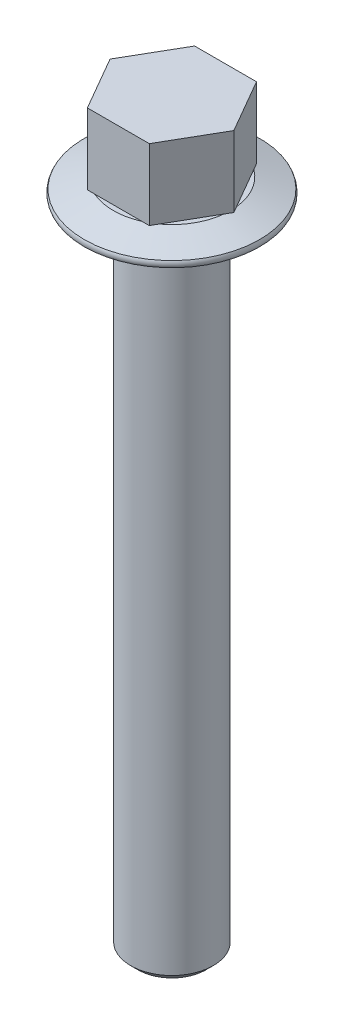
ISO-10303-21;
HEADER;
FILE_DESCRIPTION(('STEP AP214'),'2;1');
FILE_NAME('part.step','',(''),(''),'','','');
FILE_SCHEMA(('AUTOMOTIVE_DESIGN { 1 0 10303 214 1 1 1 1 }'));
ENDSEC;
DATA;
#1=APPLICATION_CONTEXT('core data for automotive mechanical design processes');
#2=APPLICATION_PROTOCOL_DEFINITION('international standard','automotive_design',2000,#1);
#3=PRODUCT_CONTEXT('',#1,'mechanical');
#4=PRODUCT('Part','Part','',(#3));
#5=PRODUCT_RELATED_PRODUCT_CATEGORY('part','',(#4));
#6=PRODUCT_DEFINITION_FORMATION('','',#4);
#7=PRODUCT_DEFINITION_CONTEXT('part definition',#1,'design');
#8=PRODUCT_DEFINITION('design','',#6,#7);
#9=PRODUCT_DEFINITION_SHAPE('','',#8);
#10=(LENGTH_UNIT() NAMED_UNIT(*) SI_UNIT(.MILLI.,.METRE.));
#11=(NAMED_UNIT(*) PLANE_ANGLE_UNIT() SI_UNIT($,.RADIAN.));
#12=(NAMED_UNIT(*) SI_UNIT($,.STERADIAN.) SOLID_ANGLE_UNIT());
#13=UNCERTAINTY_MEASURE_WITH_UNIT(LENGTH_MEASURE(1.E-05),#10,'distance_accuracy_value','');
#14=(GEOMETRIC_REPRESENTATION_CONTEXT(3) GLOBAL_UNCERTAINTY_ASSIGNED_CONTEXT((#13)) GLOBAL_UNIT_ASSIGNED_CONTEXT((#10,
#11,#12)) REPRESENTATION_CONTEXT('',''));
#15=CARTESIAN_POINT('',(0.,0.,0.));
#16=DIRECTION('',(0.,0.,1.));
#17=DIRECTION('',(1.,0.,0.));
#18=AXIS2_PLACEMENT_3D('',#15,#16,#17);
#19=CARTESIAN_POINT('',(0.,-64.,0.));
#20=DIRECTION('',(0.,1.,0.));
#21=DIRECTION('',(0.,0.,1.));
#22=AXIS2_PLACEMENT_3D('',#19,#20,#21);
#23=CYLINDRICAL_SURFACE('',#22,4.);
#24=CARTESIAN_POINT('',(0.,-62.6,0.));
#25=DIRECTION('',(0.,-1.,0.));
#26=DIRECTION('',(0.,0.,-1.));
#27=AXIS2_PLACEMENT_3D('',#24,#25,#26);
#28=CIRCLE('',#27,4.);
#29=CARTESIAN_POINT('',(0.,-62.6,-4.));
#30=VERTEX_POINT('',#29);
#31=EDGE_CURVE('E11',#30,#30,#28,.F.);
#32=ORIENTED_EDGE('',*,*,#31,.T.);
#33=EDGE_LOOP('',(#32));
#34=FACE_BOUND('',#33,.T.);
#35=CARTESIAN_POINT('',(0.,0.,0.));
#36=DIRECTION('',(0.,-1.,0.));
#37=DIRECTION('',(0.,0.,-1.));
#38=AXIS2_PLACEMENT_3D('',#35,#36,#37);
#39=CIRCLE('',#38,4.);
#40=CARTESIAN_POINT('',(0.,0.,-4.));
#41=VERTEX_POINT('',#40);
#42=EDGE_CURVE('E175',#41,#41,#39,.T.);
#43=ORIENTED_EDGE('',*,*,#42,.T.);
#44=EDGE_LOOP('',(#43));
#45=FACE_BOUND('',#44,.T.);
#46=ADVANCED_FACE('F39',(#34,#45),#23,.T.);
#47=CARTESIAN_POINT('',(5.68092213764227,1.62606042997699,0.));
#48=DIRECTION('',(0.,-1.,0.));
#49=DIRECTION('',(0.,0.,-1.));
#50=AXIS2_PLACEMENT_3D('',#47,#48,#49);
#51=PLANE('',#50);
#52=DIRECTION('',(0.5,0.,-0.866025403784439));
#53=VECTOR('',#52,1.);
#54=CARTESIAN_POINT('',(3.,1.62606042997699,5.19615242270663));
#55=LINE('',#54,#53);
#56=CARTESIAN_POINT('',(3.35186277671678,1.62606042997699,4.5867082161409));
#57=VERTEX_POINT('',#56);
#58=CARTESIAN_POINT('',(5.64813722328322,1.62606042997699,0.609444206565727));
#59=VERTEX_POINT('',#58);
#60=EDGE_CURVE('E179',#57,#59,#55,.T.);
#61=ORIENTED_EDGE('',*,*,#60,.F.);
#62=CARTESIAN_POINT('',(0.,1.62606042997699,0.));
#63=DIRECTION('',(0.,1.,0.));
#64=DIRECTION('',(0.,0.,1.));
#65=AXIS2_PLACEMENT_3D('',#62,#63,#64);
#66=CIRCLE('',#65,5.68092213764227);
#67=EDGE_CURVE('E173',#57,#59,#66,.T.);
#68=ORIENTED_EDGE('',*,*,#67,.T.);
#69=EDGE_LOOP('',(#61,#68));
#70=FACE_BOUND('',#69,.T.);
#71=ADVANCED_FACE('F285',(#70),#51,.F.);
#72=DIRECTION('',(1.,0.,0.));
#73=VECTOR('',#72,1.);
#74=CARTESIAN_POINT('',(-3.,1.62606042997699,5.19615242270663));
#75=LINE('',#74,#73);
#76=CARTESIAN_POINT('',(-2.29627444656644,1.62606042997699,5.19615242270663));
#77=VERTEX_POINT('',#76);
#78=CARTESIAN_POINT('',(2.29627444656644,1.62606042997699,5.19615242270663));
#79=VERTEX_POINT('',#78);
#80=EDGE_CURVE('E54',#77,#79,#75,.T.);
#81=ORIENTED_EDGE('',*,*,#80,.F.);
#82=EDGE_CURVE('E169',#77,#79,#66,.T.);
#83=ORIENTED_EDGE('',*,*,#82,.T.);
#84=EDGE_LOOP('',(#81,#83));
#85=FACE_BOUND('',#84,.T.);
#86=ADVANCED_FACE('F254',(#85),#51,.F.);
#87=DIRECTION('',(0.5,0.,0.866025403784438));
#88=VECTOR('',#87,1.);
#89=CARTESIAN_POINT('',(-6.,1.62606042997699,0.));
#90=LINE('',#89,#88);
#91=CARTESIAN_POINT('',(-5.64813722328322,1.62606042997699,0.60944420656573));
#92=VERTEX_POINT('',#91);
#93=CARTESIAN_POINT('',(-3.35186277671678,1.62606042997699,4.5867082161409));
#94=VERTEX_POINT('',#93);
#95=EDGE_CURVE('E211',#92,#94,#90,.T.);
#96=ORIENTED_EDGE('',*,*,#95,.F.);
#97=EDGE_CURVE('E246',#92,#94,#66,.T.);
#98=ORIENTED_EDGE('',*,*,#97,.T.);
#99=EDGE_LOOP('',(#96,#98));
#100=FACE_BOUND('',#99,.T.);
#101=ADVANCED_FACE('F350',(#100),#51,.F.);
#102=DIRECTION('',(-0.5,0.,0.866025403784439));
#103=VECTOR('',#102,1.);
#104=CARTESIAN_POINT('',(-3.,1.62606042997699,-5.19615242270663));
#105=LINE('',#104,#103);
#106=CARTESIAN_POINT('',(-3.35186277671678,1.62606042997699,-4.5867082161409));
#107=VERTEX_POINT('',#106);
#108=CARTESIAN_POINT('',(-5.64813722328322,1.62606042997699,-0.609444206565731));
#109=VERTEX_POINT('',#108);
#110=EDGE_CURVE('E206',#107,#109,#105,.T.);
#111=ORIENTED_EDGE('',*,*,#110,.F.);
#112=EDGE_CURVE('E239',#107,#109,#66,.T.);
#113=ORIENTED_EDGE('',*,*,#112,.T.);
#114=EDGE_LOOP('',(#111,#113));
#115=FACE_BOUND('',#114,.T.);
#116=ADVANCED_FACE('F328',(#115),#51,.F.);
#117=DIRECTION('',(-1.,0.,0.));
#118=VECTOR('',#117,1.);
#119=CARTESIAN_POINT('',(3.,1.62606042997699,-5.19615242270663));
#120=LINE('',#119,#118);
#121=CARTESIAN_POINT('',(2.29627444656643,1.62606042997699,-5.19615242270663));
#122=VERTEX_POINT('',#121);
#123=CARTESIAN_POINT('',(-2.29627444656643,1.62606042997699,-5.19615242270663));
#124=VERTEX_POINT('',#123);
#125=EDGE_CURVE('E201',#122,#124,#120,.T.);
#126=ORIENTED_EDGE('',*,*,#125,.F.);
#127=EDGE_CURVE('E238',#122,#124,#66,.T.);
#128=ORIENTED_EDGE('',*,*,#127,.T.);
#129=EDGE_LOOP('',(#126,#128));
#130=FACE_BOUND('',#129,.T.);
#131=ADVANCED_FACE('F323',(#130),#51,.F.);
#132=DIRECTION('',(-0.5,0.,-0.866025403784438));
#133=VECTOR('',#132,1.);
#134=CARTESIAN_POINT('',(6.,1.62606042997699,0.));
#135=LINE('',#134,#133);
#136=CARTESIAN_POINT('',(5.64813722328322,1.62606042997699,-0.609444206565728));
#137=VERTEX_POINT('',#136);
#138=CARTESIAN_POINT('',(3.35186277671678,1.62606042997699,-4.58670821614091));
#139=VERTEX_POINT('',#138);
#140=EDGE_CURVE('E172',#137,#139,#135,.T.);
#141=ORIENTED_EDGE('',*,*,#140,.F.);
#142=EDGE_CURVE('E332',#137,#139,#66,.T.);
#143=ORIENTED_EDGE('',*,*,#142,.T.);
#144=EDGE_LOOP('',(#141,#143));
#145=FACE_BOUND('',#144,.T.);
#146=ADVANCED_FACE('F292',(#145),#51,.F.);
#147=CARTESIAN_POINT('',(0.,0.6,0.));
#148=DIRECTION('',(0.,-1.,0.));
#149=DIRECTION('',(0.,0.,-1.));
#150=AXIS2_PLACEMENT_3D('',#147,#148,#149);
#151=CONICAL_SURFACE('',#150,8.5,1.22173047639604);
#152=EDGE_CURVE('E170',#79,#57,#66,.T.);
#153=ORIENTED_EDGE('',*,*,#152,.F.);
#154=ORIENTED_EDGE('',*,*,#82,.F.);
#155=EDGE_CURVE('E61',#94,#77,#66,.T.);
#156=ORIENTED_EDGE('',*,*,#155,.F.);
#157=ORIENTED_EDGE('',*,*,#97,.F.);
#158=EDGE_CURVE('E242',#109,#92,#66,.T.);
#159=ORIENTED_EDGE('',*,*,#158,.F.);
#160=ORIENTED_EDGE('',*,*,#112,.F.);
#161=EDGE_CURVE('E234',#124,#107,#66,.T.);
#162=ORIENTED_EDGE('',*,*,#161,.F.);
#163=ORIENTED_EDGE('',*,*,#127,.F.);
#164=EDGE_CURVE('E240',#139,#122,#66,.T.);
#165=ORIENTED_EDGE('',*,*,#164,.F.);
#166=ORIENTED_EDGE('',*,*,#142,.F.);
#167=EDGE_CURVE('E335',#59,#137,#66,.T.);
#168=ORIENTED_EDGE('',*,*,#167,.F.);
#169=ORIENTED_EDGE('',*,*,#67,.F.);
#170=EDGE_LOOP('',(#153,#154,#156,#157,#159,#160,#162,#163,#165,#166,#168,#169));
#171=FACE_BOUND('',#170,.T.);
#172=CARTESIAN_POINT('',(0.,0.6,0.));
#173=DIRECTION('',(0.,1.,0.));
#174=DIRECTION('',(0.,0.,1.));
#175=AXIS2_PLACEMENT_3D('',#172,#173,#174);
#176=CIRCLE('',#175,8.5);
#177=CARTESIAN_POINT('',(0.,0.6,8.5));
#178=VERTEX_POINT('',#177);
#179=EDGE_CURVE('E161',#178,#178,#176,.T.);
#180=ORIENTED_EDGE('',*,*,#179,.T.);
#181=EDGE_LOOP('',(#180));
#182=FACE_BOUND('',#181,.T.);
#183=ADVANCED_FACE('F257',(#171,#182),#151,.T.);
#184=CARTESIAN_POINT('',(0.,0.3,0.));
#185=DIRECTION('',(0.,1.,0.));
#186=DIRECTION('',(0.,0.,1.));
#187=AXIS2_PLACEMENT_3D('',#184,#185,#186);
#188=TOROIDAL_SURFACE('',#187,7.98038475772934,0.6);
#189=ORIENTED_EDGE('',*,*,#179,.F.);
#190=EDGE_LOOP('',(#189));
#191=FACE_BOUND('',#190,.T.);
#192=CARTESIAN_POINT('',(0.,0.,0.));
#193=DIRECTION('',(0.,1.,0.));
#194=DIRECTION('',(0.,0.,1.));
#195=AXIS2_PLACEMENT_3D('',#192,#193,#194);
#196=CIRCLE('',#195,8.5);
#197=CARTESIAN_POINT('',(0.,0.,8.5));
#198=VERTEX_POINT('',#197);
#199=EDGE_CURVE('E158',#198,#198,#196,.T.);
#200=ORIENTED_EDGE('',*,*,#199,.T.);
#201=EDGE_LOOP('',(#200));
#202=FACE_BOUND('',#201,.T.);
#203=ADVANCED_FACE('F314',(#191,#202),#188,.T.);
#204=CARTESIAN_POINT('',(0.,0.,0.));
#205=DIRECTION('',(0.,1.,0.));
#206=DIRECTION('',(0.,0.,1.));
#207=AXIS2_PLACEMENT_3D('',#204,#205,#206);
#208=PLANE('',#207);
#209=ORIENTED_EDGE('',*,*,#42,.F.);
#210=EDGE_LOOP('',(#209));
#211=FACE_BOUND('',#210,.T.);
#212=ORIENTED_EDGE('',*,*,#199,.F.);
#213=EDGE_LOOP('',(#212));
#214=FACE_BOUND('',#213,.T.);
#215=ADVANCED_FACE('F283',(#211,#214),#208,.F.);
#216=CARTESIAN_POINT('',(0.,1.62606042997699,0.));
#217=DIRECTION('',(0.,1.,0.));
#218=DIRECTION('',(0.,0.,1.));
#219=AXIS2_PLACEMENT_3D('',#216,#217,#218);
#220=PLANE('',#219);
#221=CARTESIAN_POINT('',(3.,1.62606042997699,5.19615242270663));
#222=VERTEX_POINT('',#221);
#223=EDGE_CURVE('E210',#79,#222,#75,.T.);
#224=ORIENTED_EDGE('',*,*,#223,.F.);
#225=ORIENTED_EDGE('',*,*,#152,.T.);
#226=EDGE_CURVE('E184',#222,#57,#55,.T.);
#227=ORIENTED_EDGE('',*,*,#226,.F.);
#228=EDGE_LOOP('',(#224,#225,#227));
#229=FACE_BOUND('',#228,.T.);
#230=ADVANCED_FACE('F262',(#229),#220,.F.);
#231=CARTESIAN_POINT('',(6.,1.62606042997699,0.));
#232=VERTEX_POINT('',#231);
#233=EDGE_CURVE('E156',#59,#232,#55,.T.);
#234=ORIENTED_EDGE('',*,*,#233,.F.);
#235=ORIENTED_EDGE('',*,*,#167,.T.);
#236=EDGE_CURVE('E194',#232,#137,#135,.T.);
#237=ORIENTED_EDGE('',*,*,#236,.F.);
#238=EDGE_LOOP('',(#234,#235,#237));
#239=FACE_BOUND('',#238,.T.);
#240=ADVANCED_FACE('F282',(#239),#220,.F.);
#241=CARTESIAN_POINT('',(3.,1.62606042997699,-5.19615242270663));
#242=VERTEX_POINT('',#241);
#243=EDGE_CURVE('E193',#139,#242,#135,.T.);
#244=ORIENTED_EDGE('',*,*,#243,.F.);
#245=ORIENTED_EDGE('',*,*,#164,.T.);
#246=EDGE_CURVE('E197',#242,#122,#120,.T.);
#247=ORIENTED_EDGE('',*,*,#246,.F.);
#248=EDGE_LOOP('',(#244,#245,#247));
#249=FACE_BOUND('',#248,.T.);
#250=ADVANCED_FACE('F340',(#249),#220,.F.);
#251=CARTESIAN_POINT('',(-3.,1.62606042997699,-5.19615242270663));
#252=VERTEX_POINT('',#251);
#253=EDGE_CURVE('E196',#124,#252,#120,.T.);
#254=ORIENTED_EDGE('',*,*,#253,.F.);
#255=ORIENTED_EDGE('',*,*,#161,.T.);
#256=EDGE_CURVE('E202',#252,#107,#105,.T.);
#257=ORIENTED_EDGE('',*,*,#256,.F.);
#258=EDGE_LOOP('',(#254,#255,#257));
#259=FACE_BOUND('',#258,.T.);
#260=ADVANCED_FACE('F232',(#259),#220,.F.);
#261=CARTESIAN_POINT('',(-6.,1.62606042997699,0.));
#262=VERTEX_POINT('',#261);
#263=EDGE_CURVE('E200',#109,#262,#105,.T.);
#264=ORIENTED_EDGE('',*,*,#263,.F.);
#265=ORIENTED_EDGE('',*,*,#158,.T.);
#266=EDGE_CURVE('E207',#262,#92,#90,.T.);
#267=ORIENTED_EDGE('',*,*,#266,.F.);
#268=EDGE_LOOP('',(#264,#265,#267));
#269=FACE_BOUND('',#268,.T.);
#270=ADVANCED_FACE('F272',(#269),#220,.F.);
#271=CARTESIAN_POINT('',(-3.,1.62606042997699,5.19615242270663));
#272=VERTEX_POINT('',#271);
#273=EDGE_CURVE('E205',#94,#272,#90,.T.);
#274=ORIENTED_EDGE('',*,*,#273,.F.);
#275=ORIENTED_EDGE('',*,*,#155,.T.);
#276=EDGE_CURVE('E150',#272,#77,#75,.T.);
#277=ORIENTED_EDGE('',*,*,#276,.F.);
#278=EDGE_LOOP('',(#274,#275,#277));
#279=FACE_BOUND('',#278,.T.);
#280=ADVANCED_FACE('F270',(#279),#220,.F.);
#281=CARTESIAN_POINT('',(3.,8.50606042997699,5.19615242270663));
#282=DIRECTION('',(-0.866025403784439,0.,-0.5));
#283=DIRECTION('',(-0.5,0.,0.866025403784439));
#284=AXIS2_PLACEMENT_3D('',#281,#282,#283);
#285=PLANE('',#284);
#286=ORIENTED_EDGE('',*,*,#226,.T.);
#287=ORIENTED_EDGE('',*,*,#60,.T.);
#288=ORIENTED_EDGE('',*,*,#233,.T.);
#289=DIRECTION('',(0.,-1.,0.));
#290=VECTOR('',#289,1.);
#291=CARTESIAN_POINT('',(6.,8.50606042997699,0.));
#292=LINE('',#291,#290);
#293=CARTESIAN_POINT('',(6.,8.50606042997699,0.));
#294=VERTEX_POINT('',#293);
#295=EDGE_CURVE('E135',#294,#232,#292,.T.);
#296=ORIENTED_EDGE('',*,*,#295,.F.);
#297=DIRECTION('',(0.5,0.,-0.866025403784439));
#298=VECTOR('',#297,1.);
#299=CARTESIAN_POINT('',(3.,8.50606042997699,5.19615242270663));
#300=LINE('',#299,#298);
#301=CARTESIAN_POINT('',(3.,8.50606042997699,5.19615242270663));
#302=VERTEX_POINT('',#301);
#303=EDGE_CURVE('E141',#302,#294,#300,.T.);
#304=ORIENTED_EDGE('',*,*,#303,.F.);
#305=DIRECTION('',(0.,-1.,0.));
#306=VECTOR('',#305,1.);
#307=CARTESIAN_POINT('',(3.,8.50606042997699,5.19615242270663));
#308=LINE('',#307,#306);
#309=EDGE_CURVE('E191',#302,#222,#308,.T.);
#310=ORIENTED_EDGE('',*,*,#309,.T.);
#311=EDGE_LOOP('',(#286,#287,#288,#296,#304,#310));
#312=FACE_BOUND('',#311,.T.);
#313=ADVANCED_FACE('F153',(#312),#285,.F.);
#314=CARTESIAN_POINT('',(6.,8.50606042997699,0.));
#315=DIRECTION('',(-0.866025403784438,0.,0.500000000000001));
#316=DIRECTION('',(0.500000000000001,0.,0.866025403784438));
#317=AXIS2_PLACEMENT_3D('',#314,#315,#316);
#318=PLANE('',#317);
#319=ORIENTED_EDGE('',*,*,#236,.T.);
#320=ORIENTED_EDGE('',*,*,#140,.T.);
#321=ORIENTED_EDGE('',*,*,#243,.T.);
#322=DIRECTION('',(0.,-1.,0.));
#323=VECTOR('',#322,1.);
#324=CARTESIAN_POINT('',(3.,8.50606042997699,-5.19615242270663));
#325=LINE('',#324,#323);
#326=CARTESIAN_POINT('',(3.,8.50606042997699,-5.19615242270663));
#327=VERTEX_POINT('',#326);
#328=EDGE_CURVE('E137',#327,#242,#325,.T.);
#329=ORIENTED_EDGE('',*,*,#328,.F.);
#330=DIRECTION('',(-0.5,0.,-0.866025403784438));
#331=VECTOR('',#330,1.);
#332=CARTESIAN_POINT('',(6.,8.50606042997699,0.));
#333=LINE('',#332,#331);
#334=EDGE_CURVE('E130',#294,#327,#333,.T.);
#335=ORIENTED_EDGE('',*,*,#334,.F.);
#336=ORIENTED_EDGE('',*,*,#295,.T.);
#337=EDGE_LOOP('',(#319,#320,#321,#329,#335,#336));
#338=FACE_BOUND('',#337,.T.);
#339=ADVANCED_FACE('F133',(#338),#318,.F.);
#340=CARTESIAN_POINT('',(3.,8.50606042997699,-5.19615242270663));
#341=DIRECTION('',(0.,0.,1.));
#342=DIRECTION('',(1.,0.,0.));
#343=AXIS2_PLACEMENT_3D('',#340,#341,#342);
#344=PLANE('',#343);
#345=ORIENTED_EDGE('',*,*,#246,.T.);
#346=ORIENTED_EDGE('',*,*,#125,.T.);
#347=ORIENTED_EDGE('',*,*,#253,.T.);
#348=DIRECTION('',(0.,-1.,0.));
#349=VECTOR('',#348,1.);
#350=CARTESIAN_POINT('',(-3.,8.50606042997699,-5.19615242270663));
#351=LINE('',#350,#349);
#352=CARTESIAN_POINT('',(-3.,8.50606042997699,-5.19615242270663));
#353=VERTEX_POINT('',#352);
#354=EDGE_CURVE('E163',#353,#252,#351,.T.);
#355=ORIENTED_EDGE('',*,*,#354,.F.);
#356=DIRECTION('',(-1.,0.,0.));
#357=VECTOR('',#356,1.);
#358=CARTESIAN_POINT('',(3.,8.50606042997699,-5.19615242270663));
#359=LINE('',#358,#357);
#360=EDGE_CURVE('E140',#327,#353,#359,.T.);
#361=ORIENTED_EDGE('',*,*,#360,.F.);
#362=ORIENTED_EDGE('',*,*,#328,.T.);
#363=EDGE_LOOP('',(#345,#346,#347,#355,#361,#362));
#364=FACE_BOUND('',#363,.T.);
#365=ADVANCED_FACE('F307',(#364),#344,.F.);
#366=CARTESIAN_POINT('',(-3.,8.50606042997699,-5.19615242270663));
#367=DIRECTION('',(0.866025403784439,0.,0.5));
#368=DIRECTION('',(0.5,0.,-0.866025403784439));
#369=AXIS2_PLACEMENT_3D('',#366,#367,#368);
#370=PLANE('',#369);
#371=ORIENTED_EDGE('',*,*,#256,.T.);
#372=ORIENTED_EDGE('',*,*,#110,.T.);
#373=ORIENTED_EDGE('',*,*,#263,.T.);
#374=DIRECTION('',(0.,-1.,0.));
#375=VECTOR('',#374,1.);
#376=CARTESIAN_POINT('',(-6.,8.50606042997699,0.));
#377=LINE('',#376,#375);
#378=CARTESIAN_POINT('',(-6.,8.50606042997699,0.));
#379=VERTEX_POINT('',#378);
#380=EDGE_CURVE('E218',#379,#262,#377,.T.);
#381=ORIENTED_EDGE('',*,*,#380,.F.);
#382=DIRECTION('',(-0.5,0.,0.866025403784439));
#383=VECTOR('',#382,1.);
#384=CARTESIAN_POINT('',(-3.,8.50606042997699,-5.19615242270663));
#385=LINE('',#384,#383);
#386=EDGE_CURVE('E187',#353,#379,#385,.T.);
#387=ORIENTED_EDGE('',*,*,#386,.F.);
#388=ORIENTED_EDGE('',*,*,#354,.T.);
#389=EDGE_LOOP('',(#371,#372,#373,#381,#387,#388));
#390=FACE_BOUND('',#389,.T.);
#391=ADVANCED_FACE('F225',(#390),#370,.F.);
#392=CARTESIAN_POINT('',(-6.,8.50606042997699,0.));
#393=DIRECTION('',(0.866025403784438,0.,-0.5));
#394=DIRECTION('',(-0.5,0.,-0.866025403784439));
#395=AXIS2_PLACEMENT_3D('',#392,#393,#394);
#396=PLANE('',#395);
#397=ORIENTED_EDGE('',*,*,#266,.T.);
#398=ORIENTED_EDGE('',*,*,#95,.T.);
#399=ORIENTED_EDGE('',*,*,#273,.T.);
#400=DIRECTION('',(0.,-1.,0.));
#401=VECTOR('',#400,1.);
#402=CARTESIAN_POINT('',(-3.,8.50606042997699,5.19615242270663));
#403=LINE('',#402,#401);
#404=CARTESIAN_POINT('',(-3.,8.50606042997699,5.19615242270663));
#405=VERTEX_POINT('',#404);
#406=EDGE_CURVE('E215',#405,#272,#403,.T.);
#407=ORIENTED_EDGE('',*,*,#406,.F.);
#408=DIRECTION('',(0.5,0.,0.866025403784438));
#409=VECTOR('',#408,1.);
#410=CARTESIAN_POINT('',(-6.,8.50606042997699,0.));
#411=LINE('',#410,#409);
#412=EDGE_CURVE('E189',#379,#405,#411,.T.);
#413=ORIENTED_EDGE('',*,*,#412,.F.);
#414=ORIENTED_EDGE('',*,*,#380,.T.);
#415=EDGE_LOOP('',(#397,#398,#399,#407,#413,#414));
#416=FACE_BOUND('',#415,.T.);
#417=ADVANCED_FACE('F268',(#416),#396,.F.);
#418=CARTESIAN_POINT('',(-3.,8.50606042997699,5.19615242270663));
#419=DIRECTION('',(0.,0.,-1.));
#420=DIRECTION('',(-1.,0.,0.));
#421=AXIS2_PLACEMENT_3D('',#418,#419,#420);
#422=PLANE('',#421);
#423=ORIENTED_EDGE('',*,*,#276,.T.);
#424=ORIENTED_EDGE('',*,*,#80,.T.);
#425=ORIENTED_EDGE('',*,*,#223,.T.);
#426=ORIENTED_EDGE('',*,*,#309,.F.);
#427=DIRECTION('',(1.,0.,0.));
#428=VECTOR('',#427,1.);
#429=CARTESIAN_POINT('',(-3.,8.50606042997699,5.19615242270663));
#430=LINE('',#429,#428);
#431=EDGE_CURVE('E146',#405,#302,#430,.T.);
#432=ORIENTED_EDGE('',*,*,#431,.F.);
#433=ORIENTED_EDGE('',*,*,#406,.T.);
#434=EDGE_LOOP('',(#423,#424,#425,#426,#432,#433));
#435=FACE_BOUND('',#434,.T.);
#436=ADVANCED_FACE('F264',(#435),#422,.F.);
#437=CARTESIAN_POINT('',(0.,8.50606042997699,0.));
#438=DIRECTION('',(0.,1.,0.));
#439=DIRECTION('',(0.,0.,1.));
#440=AXIS2_PLACEMENT_3D('',#437,#438,#439);
#441=PLANE('',#440);
#442=ORIENTED_EDGE('',*,*,#303,.T.);
#443=ORIENTED_EDGE('',*,*,#334,.T.);
#444=ORIENTED_EDGE('',*,*,#360,.T.);
#445=ORIENTED_EDGE('',*,*,#386,.T.);
#446=ORIENTED_EDGE('',*,*,#412,.T.);
#447=ORIENTED_EDGE('',*,*,#431,.T.);
#448=EDGE_LOOP('',(#442,#443,#444,#445,#446,#447));
#449=FACE_BOUND('',#448,.T.);
#450=ADVANCED_FACE('F144',(#449),#441,.T.);
#451=CARTESIAN_POINT('',(0.,-63.3,0.));
#452=DIRECTION('',(0.,-1.,0.));
#453=DIRECTION('',(0.,0.,-1.));
#454=AXIS2_PLACEMENT_3D('',#451,#452,#453);
#455=PLANE('',#454);
#456=CARTESIAN_POINT('',(0.,-63.3,0.));
#457=DIRECTION('',(0.,-1.,0.));
#458=DIRECTION('',(0.,0.,-1.));
#459=AXIS2_PLACEMENT_3D('',#456,#457,#458);
#460=CIRCLE('',#459,3.29999999999998);
#461=CARTESIAN_POINT('',(0.,-63.3,-3.29999999999998));
#462=VERTEX_POINT('',#461);
#463=EDGE_CURVE('E48',#462,#462,#460,.T.);
#464=ORIENTED_EDGE('',*,*,#463,.T.);
#465=EDGE_LOOP('',(#464));
#466=FACE_BOUND('',#465,.T.);
#467=ADVANCED_FACE('F294',(#466),#455,.T.);
#468=CARTESIAN_POINT('',(0.,-63.3,0.));
#469=DIRECTION('',(0.,1.,0.));
#470=DIRECTION('',(0.,0.,1.));
#471=AXIS2_PLACEMENT_3D('',#468,#469,#470);
#472=CONICAL_SURFACE('',#471,3.29999999999998,0.785398163397446);
#473=ORIENTED_EDGE('',*,*,#31,.F.);
#474=EDGE_LOOP('',(#473));
#475=FACE_BOUND('',#474,.T.);
#476=ORIENTED_EDGE('',*,*,#463,.F.);
#477=EDGE_LOOP('',(#476));
#478=FACE_BOUND('',#477,.T.);
#479=ADVANCED_FACE('F42',(#475,#478),#472,.T.);
#480=CLOSED_SHELL('',(#46,#71,#86,#101,#116,#131,#146,#183,#203,#215,#230,#240,#250,#260,#270,
#280,#313,#339,#365,#391,#417,#436,#450,#467,#479));
#481=MANIFOLD_SOLID_BREP('B2',#480);
#482=ADVANCED_BREP_SHAPE_REPRESENTATION('',(#18,#481),#14);
#483=SHAPE_DEFINITION_REPRESENTATION(#9,#482);
ENDSEC;
END-ISO-10303-21;
